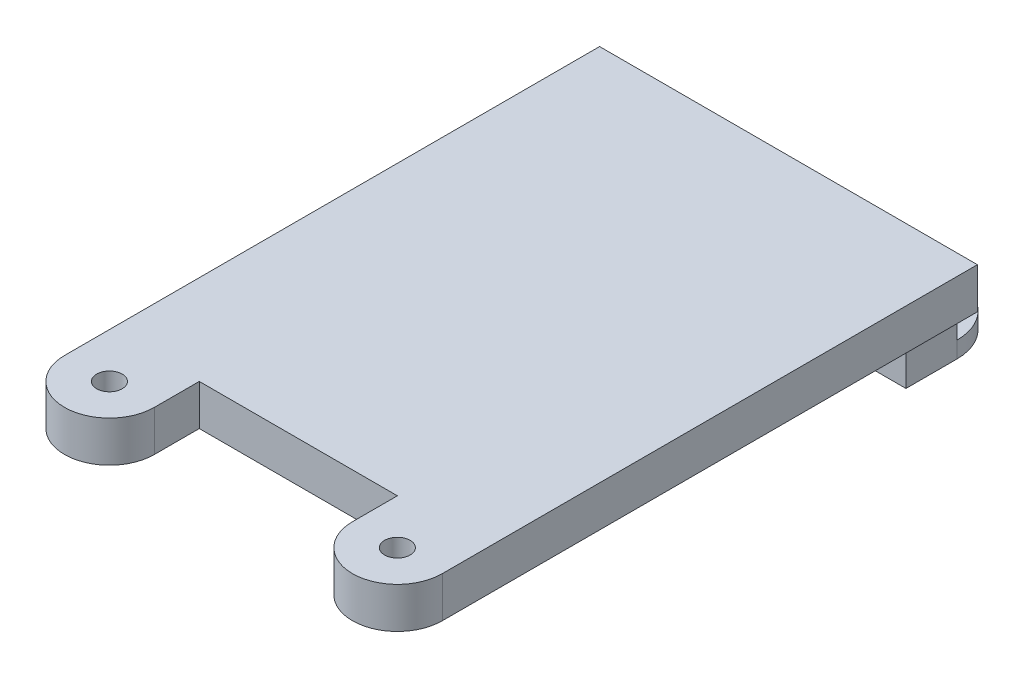
ISO-10303-21;
HEADER;
FILE_DESCRIPTION(('STEP AP214'),'2;1');
FILE_NAME('part.step','',(''),(''),'','','');
FILE_SCHEMA(('AUTOMOTIVE_DESIGN { 1 0 10303 214 1 1 1 1 }'));
ENDSEC;
DATA;
#1=APPLICATION_CONTEXT('core data for automotive mechanical design processes');
#2=APPLICATION_PROTOCOL_DEFINITION('international standard','automotive_design',2000,#1);
#3=PRODUCT_CONTEXT('',#1,'mechanical');
#4=PRODUCT('Part','Part','',(#3));
#5=PRODUCT_RELATED_PRODUCT_CATEGORY('part','',(#4));
#6=PRODUCT_DEFINITION_FORMATION('','',#4);
#7=PRODUCT_DEFINITION_CONTEXT('part definition',#1,'design');
#8=PRODUCT_DEFINITION('design','',#6,#7);
#9=PRODUCT_DEFINITION_SHAPE('','',#8);
#10=(LENGTH_UNIT() NAMED_UNIT(*) SI_UNIT(.MILLI.,.METRE.));
#11=(NAMED_UNIT(*) PLANE_ANGLE_UNIT() SI_UNIT($,.RADIAN.));
#12=(NAMED_UNIT(*) SI_UNIT($,.STERADIAN.) SOLID_ANGLE_UNIT());
#13=UNCERTAINTY_MEASURE_WITH_UNIT(LENGTH_MEASURE(1.E-05),#10,'distance_accuracy_value','');
#14=(GEOMETRIC_REPRESENTATION_CONTEXT(3) GLOBAL_UNCERTAINTY_ASSIGNED_CONTEXT((#13)) GLOBAL_UNIT_ASSIGNED_CONTEXT((#10,
#11,#12)) REPRESENTATION_CONTEXT('',''));
#15=CARTESIAN_POINT('',(0.,0.,0.));
#16=DIRECTION('',(0.,0.,1.));
#17=DIRECTION('',(1.,0.,0.));
#18=AXIS2_PLACEMENT_3D('',#15,#16,#17);
#19=CARTESIAN_POINT('',(0.,2.,-12.));
#20=DIRECTION('',(0.,0.,-1.));
#21=DIRECTION('',(-1.,0.,0.));
#22=AXIS2_PLACEMENT_3D('',#19,#20,#21);
#23=PLANE('',#22);
#24=DIRECTION('',(0.,1.,0.));
#25=VECTOR('',#24,1.);
#26=CARTESIAN_POINT('',(8.25,-2.5,-12.));
#27=LINE('',#26,#25);
#28=CARTESIAN_POINT('',(8.25,-1.7,-12.));
#29=VERTEX_POINT('',#28);
#30=CARTESIAN_POINT('',(8.25,0.,-12.));
#31=VERTEX_POINT('',#30);
#32=EDGE_CURVE('E147',#29,#31,#27,.T.);
#33=ORIENTED_EDGE('',*,*,#32,.F.);
#34=DIRECTION('',(-1.,0.,0.));
#35=VECTOR('',#34,1.);
#36=CARTESIAN_POINT('',(8.25,-1.7,-12.));
#37=LINE('',#36,#35);
#38=CARTESIAN_POINT('',(-8.25,-1.7,-12.));
#39=VERTEX_POINT('',#38);
#40=EDGE_CURVE('E153',#29,#39,#37,.T.);
#41=ORIENTED_EDGE('',*,*,#40,.T.);
#42=DIRECTION('',(0.,1.,0.));
#43=VECTOR('',#42,1.);
#44=CARTESIAN_POINT('',(-8.25,-2.5,-12.));
#45=LINE('',#44,#43);
#46=CARTESIAN_POINT('',(-8.25,0.,-12.));
#47=VERTEX_POINT('',#46);
#48=EDGE_CURVE('E164',#39,#47,#45,.T.);
#49=ORIENTED_EDGE('',*,*,#48,.T.);
#50=DIRECTION('',(1.,0.,0.));
#51=VECTOR('',#50,1.);
#52=CARTESIAN_POINT('',(0.,0.,-12.));
#53=LINE('',#52,#51);
#54=CARTESIAN_POINT('',(-9.25,0.,-12.));
#55=VERTEX_POINT('',#54);
#56=EDGE_CURVE('E220',#55,#47,#53,.T.);
#57=ORIENTED_EDGE('',*,*,#56,.F.);
#58=DIRECTION('',(0.,-1.,0.));
#59=VECTOR('',#58,1.);
#60=CARTESIAN_POINT('',(-9.25,2.,-12.));
#61=LINE('',#60,#59);
#62=CARTESIAN_POINT('',(-9.25,2.,-12.));
#63=VERTEX_POINT('',#62);
#64=EDGE_CURVE('E251',#63,#55,#61,.T.);
#65=ORIENTED_EDGE('',*,*,#64,.F.);
#66=DIRECTION('',(1.,0.,0.));
#67=VECTOR('',#66,1.);
#68=CARTESIAN_POINT('',(0.,2.,-12.));
#69=LINE('',#68,#67);
#70=CARTESIAN_POINT('',(9.25,2.,-12.));
#71=VERTEX_POINT('',#70);
#72=EDGE_CURVE('E296',#63,#71,#69,.T.);
#73=ORIENTED_EDGE('',*,*,#72,.T.);
#74=DIRECTION('',(0.,-1.,0.));
#75=VECTOR('',#74,1.);
#76=CARTESIAN_POINT('',(9.25,2.,-12.));
#77=LINE('',#76,#75);
#78=CARTESIAN_POINT('',(9.25,0.,-12.));
#79=VERTEX_POINT('',#78);
#80=EDGE_CURVE('E253',#71,#79,#77,.T.);
#81=ORIENTED_EDGE('',*,*,#80,.T.);
#82=EDGE_CURVE('E163',#31,#79,#53,.T.);
#83=ORIENTED_EDGE('',*,*,#82,.F.);
#84=EDGE_LOOP('',(#33,#41,#49,#57,#65,#73,#81,#83));
#85=FACE_BOUND('',#84,.T.);
#86=ADVANCED_FACE('F35',(#85),#23,.T.);
#87=CARTESIAN_POINT('',(0.,0.,0.));
#88=DIRECTION('',(0.,1.,0.));
#89=DIRECTION('',(0.,0.,1.));
#90=AXIS2_PLACEMENT_3D('',#87,#88,#89);
#91=PLANE('',#90);
#92=CARTESIAN_POINT('',(-7.05,0.,14.2));
#93=DIRECTION('',(0.,1.,0.));
#94=DIRECTION('',(0.,0.,1.));
#95=AXIS2_PLACEMENT_3D('',#92,#93,#94);
#96=CIRCLE('',#95,0.625);
#97=CARTESIAN_POINT('',(-7.05,0.,14.825));
#98=VERTEX_POINT('',#97);
#99=EDGE_CURVE('E238',#98,#98,#96,.T.);
#100=ORIENTED_EDGE('',*,*,#99,.T.);
#101=EDGE_LOOP('',(#100));
#102=FACE_BOUND('',#101,.T.);
#103=CARTESIAN_POINT('',(7.05,0.,14.2));
#104=DIRECTION('',(0.,1.,0.));
#105=DIRECTION('',(0.,0.,1.));
#106=AXIS2_PLACEMENT_3D('',#103,#104,#105);
#107=CIRCLE('',#106,0.625);
#108=CARTESIAN_POINT('',(7.05,0.,14.825));
#109=VERTEX_POINT('',#108);
#110=EDGE_CURVE('E235',#109,#109,#107,.T.);
#111=ORIENTED_EDGE('',*,*,#110,.T.);
#112=EDGE_LOOP('',(#111));
#113=FACE_BOUND('',#112,.T.);
#114=DIRECTION('',(0.,0.,-1.));
#115=VECTOR('',#114,1.);
#116=CARTESIAN_POINT('',(-8.25,0.,-12.));
#117=LINE('',#116,#115);
#118=CARTESIAN_POINT('',(-8.25,0.,-9.5));
#119=VERTEX_POINT('',#118);
#120=EDGE_CURVE('E194',#119,#47,#117,.T.);
#121=ORIENTED_EDGE('',*,*,#120,.F.);
#122=DIRECTION('',(-1.,0.,0.));
#123=VECTOR('',#122,1.);
#124=CARTESIAN_POINT('',(-8.25,0.,-9.5));
#125=LINE('',#124,#123);
#126=CARTESIAN_POINT('',(8.25,0.,-9.5));
#127=VERTEX_POINT('',#126);
#128=EDGE_CURVE('E200',#127,#119,#125,.T.);
#129=ORIENTED_EDGE('',*,*,#128,.F.);
#130=DIRECTION('',(0.,0.,1.));
#131=VECTOR('',#130,1.);
#132=CARTESIAN_POINT('',(8.25,0.,-12.));
#133=LINE('',#132,#131);
#134=EDGE_CURVE('E210',#31,#127,#133,.T.);
#135=ORIENTED_EDGE('',*,*,#134,.F.);
#136=ORIENTED_EDGE('',*,*,#82,.T.);
#137=DIRECTION('',(0.,0.,-1.));
#138=VECTOR('',#137,1.);
#139=CARTESIAN_POINT('',(9.25,0.,0.));
#140=LINE('',#139,#138);
#141=CARTESIAN_POINT('',(9.25,0.,14.2));
#142=VERTEX_POINT('',#141);
#143=EDGE_CURVE('E221',#142,#79,#140,.T.);
#144=ORIENTED_EDGE('',*,*,#143,.F.);
#145=CARTESIAN_POINT('',(7.05,0.,14.2));
#146=DIRECTION('',(0.,1.,0.));
#147=DIRECTION('',(0.,0.,1.));
#148=AXIS2_PLACEMENT_3D('',#145,#146,#147);
#149=CIRCLE('',#148,2.2);
#150=CARTESIAN_POINT('',(4.85,0.,14.2));
#151=VERTEX_POINT('',#150);
#152=EDGE_CURVE('E281',#151,#142,#149,.T.);
#153=ORIENTED_EDGE('',*,*,#152,.F.);
#154=DIRECTION('',(0.,0.,-1.));
#155=VECTOR('',#154,1.);
#156=CARTESIAN_POINT('',(4.85,0.,0.));
#157=LINE('',#156,#155);
#158=CARTESIAN_POINT('',(4.85,0.,12.));
#159=VERTEX_POINT('',#158);
#160=EDGE_CURVE('E266',#151,#159,#157,.T.);
#161=ORIENTED_EDGE('',*,*,#160,.T.);
#162=DIRECTION('',(1.,0.,0.));
#163=VECTOR('',#162,1.);
#164=CARTESIAN_POINT('',(0.,0.,12.));
#165=LINE('',#164,#163);
#166=CARTESIAN_POINT('',(-4.85,0.,12.));
#167=VERTEX_POINT('',#166);
#168=EDGE_CURVE('E272',#167,#159,#165,.T.);
#169=ORIENTED_EDGE('',*,*,#168,.F.);
#170=DIRECTION('',(0.,0.,-1.));
#171=VECTOR('',#170,1.);
#172=CARTESIAN_POINT('',(-4.85,0.,0.));
#173=LINE('',#172,#171);
#174=CARTESIAN_POINT('',(-4.85,0.,14.2));
#175=VERTEX_POINT('',#174);
#176=EDGE_CURVE('E233',#175,#167,#173,.T.);
#177=ORIENTED_EDGE('',*,*,#176,.F.);
#178=CARTESIAN_POINT('',(-7.05,0.,14.2));
#179=DIRECTION('',(0.,1.,0.));
#180=DIRECTION('',(0.,0.,1.));
#181=AXIS2_PLACEMENT_3D('',#178,#179,#180);
#182=CIRCLE('',#181,2.2);
#183=CARTESIAN_POINT('',(-9.25,0.,14.2));
#184=VERTEX_POINT('',#183);
#185=EDGE_CURVE('E231',#184,#175,#182,.T.);
#186=ORIENTED_EDGE('',*,*,#185,.F.);
#187=DIRECTION('',(0.,0.,-1.));
#188=VECTOR('',#187,1.);
#189=CARTESIAN_POINT('',(-9.25,0.,0.));
#190=LINE('',#189,#188);
#191=EDGE_CURVE('E227',#184,#55,#190,.T.);
#192=ORIENTED_EDGE('',*,*,#191,.T.);
#193=ORIENTED_EDGE('',*,*,#56,.T.);
#194=EDGE_LOOP('',(#121,#129,#135,#136,#144,#153,#161,#169,#177,#186,#192,#193));
#195=FACE_BOUND('',#194,.T.);
#196=ADVANCED_FACE('F279',(#102,#113,#195),#91,.F.);
#197=CARTESIAN_POINT('',(0.,2.,12.));
#198=DIRECTION('',(0.,0.,-1.));
#199=DIRECTION('',(-1.,0.,0.));
#200=AXIS2_PLACEMENT_3D('',#197,#198,#199);
#201=PLANE('',#200);
#202=ORIENTED_EDGE('',*,*,#168,.T.);
#203=DIRECTION('',(0.,-1.,0.));
#204=VECTOR('',#203,1.);
#205=CARTESIAN_POINT('',(4.85,2.,12.));
#206=LINE('',#205,#204);
#207=CARTESIAN_POINT('',(4.85,2.,12.));
#208=VERTEX_POINT('',#207);
#209=EDGE_CURVE('E187',#208,#159,#206,.T.);
#210=ORIENTED_EDGE('',*,*,#209,.F.);
#211=DIRECTION('',(1.,0.,0.));
#212=VECTOR('',#211,1.);
#213=CARTESIAN_POINT('',(0.,2.,12.));
#214=LINE('',#213,#212);
#215=CARTESIAN_POINT('',(-4.85,2.,12.));
#216=VERTEX_POINT('',#215);
#217=EDGE_CURVE('E241',#216,#208,#214,.T.);
#218=ORIENTED_EDGE('',*,*,#217,.F.);
#219=DIRECTION('',(0.,-1.,0.));
#220=VECTOR('',#219,1.);
#221=CARTESIAN_POINT('',(-4.85,2.,12.));
#222=LINE('',#221,#220);
#223=EDGE_CURVE('E242',#216,#167,#222,.T.);
#224=ORIENTED_EDGE('',*,*,#223,.T.);
#225=EDGE_LOOP('',(#202,#210,#218,#224));
#226=FACE_BOUND('',#225,.T.);
#227=ADVANCED_FACE('F273',(#226),#201,.F.);
#228=CARTESIAN_POINT('',(4.85,2.,0.));
#229=DIRECTION('',(-1.,0.,0.));
#230=DIRECTION('',(0.,0.,1.));
#231=AXIS2_PLACEMENT_3D('',#228,#229,#230);
#232=PLANE('',#231);
#233=ORIENTED_EDGE('',*,*,#160,.F.);
#234=DIRECTION('',(0.,-1.,0.));
#235=VECTOR('',#234,1.);
#236=CARTESIAN_POINT('',(4.85,2.,14.2));
#237=LINE('',#236,#235);
#238=CARTESIAN_POINT('',(4.85,2.,14.2));
#239=VERTEX_POINT('',#238);
#240=EDGE_CURVE('E258',#239,#151,#237,.T.);
#241=ORIENTED_EDGE('',*,*,#240,.F.);
#242=DIRECTION('',(0.,0.,-1.));
#243=VECTOR('',#242,1.);
#244=CARTESIAN_POINT('',(4.85,2.,0.));
#245=LINE('',#244,#243);
#246=EDGE_CURVE('E268',#239,#208,#245,.T.);
#247=ORIENTED_EDGE('',*,*,#246,.T.);
#248=ORIENTED_EDGE('',*,*,#209,.T.);
#249=EDGE_LOOP('',(#233,#241,#247,#248));
#250=FACE_BOUND('',#249,.T.);
#251=ADVANCED_FACE('F264',(#250),#232,.T.);
#252=CARTESIAN_POINT('',(7.05,2.,14.2));
#253=DIRECTION('',(0.,-1.,0.));
#254=DIRECTION('',(0.,0.,-1.));
#255=AXIS2_PLACEMENT_3D('',#252,#253,#254);
#256=CYLINDRICAL_SURFACE('',#255,2.2);
#257=ORIENTED_EDGE('',*,*,#152,.T.);
#258=DIRECTION('',(0.,-1.,0.));
#259=VECTOR('',#258,1.);
#260=CARTESIAN_POINT('',(9.25,2.,14.2));
#261=LINE('',#260,#259);
#262=CARTESIAN_POINT('',(9.25,2.,14.2));
#263=VERTEX_POINT('',#262);
#264=EDGE_CURVE('E255',#263,#142,#261,.T.);
#265=ORIENTED_EDGE('',*,*,#264,.F.);
#266=CARTESIAN_POINT('',(7.05,2.,14.2));
#267=DIRECTION('',(0.,1.,0.));
#268=DIRECTION('',(0.,0.,1.));
#269=AXIS2_PLACEMENT_3D('',#266,#267,#268);
#270=CIRCLE('',#269,2.2);
#271=EDGE_CURVE('E301',#239,#263,#270,.T.);
#272=ORIENTED_EDGE('',*,*,#271,.F.);
#273=ORIENTED_EDGE('',*,*,#240,.T.);
#274=EDGE_LOOP('',(#257,#265,#272,#273));
#275=FACE_BOUND('',#274,.T.);
#276=ADVANCED_FACE('F348',(#275),#256,.T.);
#277=CARTESIAN_POINT('',(9.25,2.,0.));
#278=DIRECTION('',(-1.,0.,0.));
#279=DIRECTION('',(0.,0.,1.));
#280=AXIS2_PLACEMENT_3D('',#277,#278,#279);
#281=PLANE('',#280);
#282=ORIENTED_EDGE('',*,*,#143,.T.);
#283=ORIENTED_EDGE('',*,*,#80,.F.);
#284=DIRECTION('',(0.,0.,-1.));
#285=VECTOR('',#284,1.);
#286=CARTESIAN_POINT('',(9.25,2.,0.));
#287=LINE('',#286,#285);
#288=EDGE_CURVE('E299',#263,#71,#287,.T.);
#289=ORIENTED_EDGE('',*,*,#288,.F.);
#290=ORIENTED_EDGE('',*,*,#264,.T.);
#291=EDGE_LOOP('',(#282,#283,#289,#290));
#292=FACE_BOUND('',#291,.T.);
#293=ADVANCED_FACE('F345',(#292),#281,.F.);
#294=CARTESIAN_POINT('',(-9.25,2.,0.));
#295=DIRECTION('',(-1.,0.,0.));
#296=DIRECTION('',(0.,0.,1.));
#297=AXIS2_PLACEMENT_3D('',#294,#295,#296);
#298=PLANE('',#297);
#299=ORIENTED_EDGE('',*,*,#191,.F.);
#300=DIRECTION('',(0.,-1.,0.));
#301=VECTOR('',#300,1.);
#302=CARTESIAN_POINT('',(-9.25,2.,14.2));
#303=LINE('',#302,#301);
#304=CARTESIAN_POINT('',(-9.25,2.,14.2));
#305=VERTEX_POINT('',#304);
#306=EDGE_CURVE('E249',#305,#184,#303,.T.);
#307=ORIENTED_EDGE('',*,*,#306,.F.);
#308=DIRECTION('',(0.,0.,-1.));
#309=VECTOR('',#308,1.);
#310=CARTESIAN_POINT('',(-9.25,2.,0.));
#311=LINE('',#310,#309);
#312=EDGE_CURVE('E293',#305,#63,#311,.T.);
#313=ORIENTED_EDGE('',*,*,#312,.T.);
#314=ORIENTED_EDGE('',*,*,#64,.T.);
#315=EDGE_LOOP('',(#299,#307,#313,#314));
#316=FACE_BOUND('',#315,.T.);
#317=ADVANCED_FACE('F343',(#316),#298,.T.);
#318=CARTESIAN_POINT('',(-7.05,2.,14.2));
#319=DIRECTION('',(0.,-1.,0.));
#320=DIRECTION('',(0.,0.,-1.));
#321=AXIS2_PLACEMENT_3D('',#318,#319,#320);
#322=CYLINDRICAL_SURFACE('',#321,2.2);
#323=ORIENTED_EDGE('',*,*,#185,.T.);
#324=DIRECTION('',(0.,-1.,0.));
#325=VECTOR('',#324,1.);
#326=CARTESIAN_POINT('',(-4.85,2.,14.2));
#327=LINE('',#326,#325);
#328=CARTESIAN_POINT('',(-4.85,2.,14.2));
#329=VERTEX_POINT('',#328);
#330=EDGE_CURVE('E245',#329,#175,#327,.T.);
#331=ORIENTED_EDGE('',*,*,#330,.F.);
#332=CARTESIAN_POINT('',(-7.05,2.,14.2));
#333=DIRECTION('',(0.,1.,0.));
#334=DIRECTION('',(0.,0.,1.));
#335=AXIS2_PLACEMENT_3D('',#332,#333,#334);
#336=CIRCLE('',#335,2.2);
#337=EDGE_CURVE('E291',#305,#329,#336,.T.);
#338=ORIENTED_EDGE('',*,*,#337,.F.);
#339=ORIENTED_EDGE('',*,*,#306,.T.);
#340=EDGE_LOOP('',(#323,#331,#338,#339));
#341=FACE_BOUND('',#340,.T.);
#342=ADVANCED_FACE('F464',(#341),#322,.T.);
#343=CARTESIAN_POINT('',(7.05,2.,14.2));
#344=DIRECTION('',(0.,-1.,0.));
#345=DIRECTION('',(0.,0.,-1.));
#346=AXIS2_PLACEMENT_3D('',#343,#344,#345);
#347=CYLINDRICAL_SURFACE('',#346,0.625);
#348=CARTESIAN_POINT('',(7.05,2.,14.2));
#349=DIRECTION('',(0.,1.,0.));
#350=DIRECTION('',(0.,0.,1.));
#351=AXIS2_PLACEMENT_3D('',#348,#349,#350);
#352=CIRCLE('',#351,0.625);
#353=CARTESIAN_POINT('',(7.05,2.,14.825));
#354=VERTEX_POINT('',#353);
#355=EDGE_CURVE('E286',#354,#354,#352,.T.);
#356=ORIENTED_EDGE('',*,*,#355,.T.);
#357=EDGE_LOOP('',(#356));
#358=FACE_BOUND('',#357,.T.);
#359=ORIENTED_EDGE('',*,*,#110,.F.);
#360=EDGE_LOOP('',(#359));
#361=FACE_BOUND('',#360,.T.);
#362=ADVANCED_FACE('F454',(#358,#361),#347,.F.);
#363=CARTESIAN_POINT('',(-4.85,2.,0.));
#364=DIRECTION('',(-1.,0.,0.));
#365=DIRECTION('',(0.,0.,1.));
#366=AXIS2_PLACEMENT_3D('',#363,#364,#365);
#367=PLANE('',#366);
#368=ORIENTED_EDGE('',*,*,#176,.T.);
#369=ORIENTED_EDGE('',*,*,#223,.F.);
#370=DIRECTION('',(0.,0.,-1.));
#371=VECTOR('',#370,1.);
#372=CARTESIAN_POINT('',(-4.85,2.,0.));
#373=LINE('',#372,#371);
#374=EDGE_CURVE('E289',#329,#216,#373,.T.);
#375=ORIENTED_EDGE('',*,*,#374,.F.);
#376=ORIENTED_EDGE('',*,*,#330,.T.);
#377=EDGE_LOOP('',(#368,#369,#375,#376));
#378=FACE_BOUND('',#377,.T.);
#379=ADVANCED_FACE('F443',(#378),#367,.F.);
#380=CARTESIAN_POINT('',(-7.05,2.,14.2));
#381=DIRECTION('',(0.,-1.,0.));
#382=DIRECTION('',(0.,0.,-1.));
#383=AXIS2_PLACEMENT_3D('',#380,#381,#382);
#384=CYLINDRICAL_SURFACE('',#383,0.625);
#385=CARTESIAN_POINT('',(-7.05,2.,14.2));
#386=DIRECTION('',(0.,1.,0.));
#387=DIRECTION('',(0.,0.,1.));
#388=AXIS2_PLACEMENT_3D('',#385,#386,#387);
#389=CIRCLE('',#388,0.625);
#390=CARTESIAN_POINT('',(-7.05,2.,14.825));
#391=VERTEX_POINT('',#390);
#392=EDGE_CURVE('E246',#391,#391,#389,.T.);
#393=ORIENTED_EDGE('',*,*,#392,.T.);
#394=EDGE_LOOP('',(#393));
#395=FACE_BOUND('',#394,.T.);
#396=ORIENTED_EDGE('',*,*,#99,.F.);
#397=EDGE_LOOP('',(#396));
#398=FACE_BOUND('',#397,.T.);
#399=ADVANCED_FACE('F431',(#395,#398),#384,.F.);
#400=CARTESIAN_POINT('',(0.,2.,0.));
#401=DIRECTION('',(0.,1.,0.));
#402=DIRECTION('',(0.,0.,1.));
#403=AXIS2_PLACEMENT_3D('',#400,#401,#402);
#404=PLANE('',#403);
#405=ORIENTED_EDGE('',*,*,#217,.T.);
#406=ORIENTED_EDGE('',*,*,#246,.F.);
#407=ORIENTED_EDGE('',*,*,#271,.T.);
#408=ORIENTED_EDGE('',*,*,#288,.T.);
#409=ORIENTED_EDGE('',*,*,#72,.F.);
#410=ORIENTED_EDGE('',*,*,#312,.F.);
#411=ORIENTED_EDGE('',*,*,#337,.T.);
#412=ORIENTED_EDGE('',*,*,#374,.T.);
#413=EDGE_LOOP('',(#405,#406,#407,#408,#409,#410,#411,#412));
#414=FACE_BOUND('',#413,.T.);
#415=ORIENTED_EDGE('',*,*,#355,.F.);
#416=EDGE_LOOP('',(#415));
#417=FACE_BOUND('',#416,.T.);
#418=ORIENTED_EDGE('',*,*,#392,.F.);
#419=EDGE_LOOP('',(#418));
#420=FACE_BOUND('',#419,.T.);
#421=ADVANCED_FACE('F401',(#414,#417,#420),#404,.T.);
#422=CARTESIAN_POINT('',(-8.25,-2.5,-12.));
#423=DIRECTION('',(1.,0.,0.));
#424=DIRECTION('',(0.,0.,-1.));
#425=AXIS2_PLACEMENT_3D('',#422,#423,#424);
#426=PLANE('',#425);
#427=ORIENTED_EDGE('',*,*,#48,.F.);
#428=DIRECTION('',(0.,-1.,0.));
#429=VECTOR('',#428,1.);
#430=CARTESIAN_POINT('',(-8.25,-2.5,-12.));
#431=LINE('',#430,#429);
#432=CARTESIAN_POINT('',(-8.25,-2.5,-12.));
#433=VERTEX_POINT('',#432);
#434=EDGE_CURVE('E183',#39,#433,#431,.T.);
#435=ORIENTED_EDGE('',*,*,#434,.T.);
#436=DIRECTION('',(0.,0.,-1.));
#437=VECTOR('',#436,1.);
#438=CARTESIAN_POINT('',(-8.25,-2.5,-12.));
#439=LINE('',#438,#437);
#440=CARTESIAN_POINT('',(-8.25,-2.5,-9.5));
#441=VERTEX_POINT('',#440);
#442=EDGE_CURVE('E197',#441,#433,#439,.T.);
#443=ORIENTED_EDGE('',*,*,#442,.F.);
#444=DIRECTION('',(0.,1.,0.));
#445=VECTOR('',#444,1.);
#446=CARTESIAN_POINT('',(-8.25,-2.5,-9.5));
#447=LINE('',#446,#445);
#448=EDGE_CURVE('E204',#441,#119,#447,.T.);
#449=ORIENTED_EDGE('',*,*,#448,.T.);
#450=ORIENTED_EDGE('',*,*,#120,.T.);
#451=EDGE_LOOP('',(#427,#435,#443,#449,#450));
#452=FACE_BOUND('',#451,.T.);
#453=ADVANCED_FACE('F310',(#452),#426,.F.);
#454=CARTESIAN_POINT('',(8.25,-2.5,-12.));
#455=DIRECTION('',(-1.,0.,0.));
#456=DIRECTION('',(0.,0.,1.));
#457=AXIS2_PLACEMENT_3D('',#454,#455,#456);
#458=PLANE('',#457);
#459=DIRECTION('',(0.,0.,1.));
#460=VECTOR('',#459,1.);
#461=CARTESIAN_POINT('',(8.25,-2.5,-12.));
#462=LINE('',#461,#460);
#463=CARTESIAN_POINT('',(8.25,-2.5,-12.));
#464=VERTEX_POINT('',#463);
#465=CARTESIAN_POINT('',(8.25,-2.5,-9.5));
#466=VERTEX_POINT('',#465);
#467=EDGE_CURVE('E150',#464,#466,#462,.T.);
#468=ORIENTED_EDGE('',*,*,#467,.F.);
#469=DIRECTION('',(0.,-1.,0.));
#470=VECTOR('',#469,1.);
#471=CARTESIAN_POINT('',(8.25,-1.7,-12.));
#472=LINE('',#471,#470);
#473=EDGE_CURVE('E11',#464,#29,#472,.F.);
#474=ORIENTED_EDGE('',*,*,#473,.T.);
#475=ORIENTED_EDGE('',*,*,#32,.T.);
#476=ORIENTED_EDGE('',*,*,#134,.T.);
#477=DIRECTION('',(0.,1.,0.));
#478=VECTOR('',#477,1.);
#479=CARTESIAN_POINT('',(8.25,-2.5,-9.5));
#480=LINE('',#479,#478);
#481=EDGE_CURVE('E165',#466,#127,#480,.T.);
#482=ORIENTED_EDGE('',*,*,#481,.F.);
#483=EDGE_LOOP('',(#468,#474,#475,#476,#482));
#484=FACE_BOUND('',#483,.T.);
#485=ADVANCED_FACE('F144',(#484),#458,.F.);
#486=CARTESIAN_POINT('',(-8.25,-2.5,-9.5));
#487=DIRECTION('',(0.,0.,-1.));
#488=DIRECTION('',(-1.,0.,0.));
#489=AXIS2_PLACEMENT_3D('',#486,#487,#488);
#490=PLANE('',#489);
#491=ORIENTED_EDGE('',*,*,#128,.T.);
#492=ORIENTED_EDGE('',*,*,#448,.F.);
#493=DIRECTION('',(-1.,0.,0.));
#494=VECTOR('',#493,1.);
#495=CARTESIAN_POINT('',(-8.25,-2.5,-9.5));
#496=LINE('',#495,#494);
#497=EDGE_CURVE('E202',#466,#441,#496,.T.);
#498=ORIENTED_EDGE('',*,*,#497,.F.);
#499=ORIENTED_EDGE('',*,*,#481,.T.);
#500=EDGE_LOOP('',(#491,#492,#498,#499));
#501=FACE_BOUND('',#500,.T.);
#502=ADVANCED_FACE('F314',(#501),#490,.F.);
#503=CARTESIAN_POINT('',(0.,-2.5,0.));
#504=DIRECTION('',(0.,1.,0.));
#505=DIRECTION('',(0.,0.,1.));
#506=AXIS2_PLACEMENT_3D('',#503,#504,#505);
#507=PLANE('',#506);
#508=ORIENTED_EDGE('',*,*,#442,.T.);
#509=CARTESIAN_POINT('',(-5.75,-2.5,-12.));
#510=DIRECTION('',(0.,1.,0.));
#511=DIRECTION('',(0.,0.,1.));
#512=AXIS2_PLACEMENT_3D('',#509,#510,#511);
#513=CIRCLE('',#512,2.5);
#514=CARTESIAN_POINT('',(-5.75,-2.5,-14.5));
#515=VERTEX_POINT('',#514);
#516=EDGE_CURVE('E179',#433,#515,#513,.F.);
#517=ORIENTED_EDGE('',*,*,#516,.T.);
#518=DIRECTION('',(1.,0.,0.));
#519=VECTOR('',#518,1.);
#520=CARTESIAN_POINT('',(8.25,-2.5,-14.5));
#521=LINE('',#520,#519);
#522=CARTESIAN_POINT('',(5.75,-2.5,-14.5));
#523=VERTEX_POINT('',#522);
#524=EDGE_CURVE('E159',#515,#523,#521,.T.);
#525=ORIENTED_EDGE('',*,*,#524,.T.);
#526=CARTESIAN_POINT('',(5.75,-2.5,-12.));
#527=DIRECTION('',(0.,1.,0.));
#528=DIRECTION('',(0.,0.,1.));
#529=AXIS2_PLACEMENT_3D('',#526,#527,#528);
#530=CIRCLE('',#529,2.5);
#531=EDGE_CURVE('E181',#523,#464,#530,.F.);
#532=ORIENTED_EDGE('',*,*,#531,.T.);
#533=ORIENTED_EDGE('',*,*,#467,.T.);
#534=ORIENTED_EDGE('',*,*,#497,.T.);
#535=EDGE_LOOP('',(#508,#517,#525,#532,#533,#534));
#536=FACE_BOUND('',#535,.T.);
#537=ADVANCED_FACE('F324',(#536),#507,.F.);
#538=CARTESIAN_POINT('',(8.25,-1.7,-14.5));
#539=DIRECTION('',(0.,0.,-1.));
#540=DIRECTION('',(-1.,0.,0.));
#541=AXIS2_PLACEMENT_3D('',#538,#539,#540);
#542=PLANE('',#541);
#543=ORIENTED_EDGE('',*,*,#524,.F.);
#544=DIRECTION('',(0.,-1.,0.));
#545=VECTOR('',#544,1.);
#546=CARTESIAN_POINT('',(-5.75,-1.7,-14.5));
#547=LINE('',#546,#545);
#548=CARTESIAN_POINT('',(-5.75,-1.7,-14.5));
#549=VERTEX_POINT('',#548);
#550=EDGE_CURVE('E58',#515,#549,#547,.F.);
#551=ORIENTED_EDGE('',*,*,#550,.T.);
#552=DIRECTION('',(1.,0.,0.));
#553=VECTOR('',#552,1.);
#554=CARTESIAN_POINT('',(8.25,-1.7,-14.5));
#555=LINE('',#554,#553);
#556=CARTESIAN_POINT('',(5.75,-1.7,-14.5));
#557=VERTEX_POINT('',#556);
#558=EDGE_CURVE('E158',#549,#557,#555,.T.);
#559=ORIENTED_EDGE('',*,*,#558,.T.);
#560=DIRECTION('',(0.,-1.,0.));
#561=VECTOR('',#560,1.);
#562=CARTESIAN_POINT('',(5.75,-2.5,-14.5));
#563=LINE('',#562,#561);
#564=EDGE_CURVE('E169',#557,#523,#563,.T.);
#565=ORIENTED_EDGE('',*,*,#564,.T.);
#566=EDGE_LOOP('',(#543,#551,#559,#565));
#567=FACE_BOUND('',#566,.T.);
#568=ADVANCED_FACE('F325',(#567),#542,.T.);
#569=CARTESIAN_POINT('',(0.,-1.7,0.));
#570=DIRECTION('',(0.,1.,0.));
#571=DIRECTION('',(0.,0.,1.));
#572=AXIS2_PLACEMENT_3D('',#569,#570,#571);
#573=PLANE('',#572);
#574=ORIENTED_EDGE('',*,*,#558,.F.);
#575=CARTESIAN_POINT('',(-5.75,-1.7,-12.));
#576=DIRECTION('',(0.,1.,0.));
#577=DIRECTION('',(0.,0.,1.));
#578=AXIS2_PLACEMENT_3D('',#575,#576,#577);
#579=CIRCLE('',#578,2.5);
#580=EDGE_CURVE('E44',#549,#39,#579,.T.);
#581=ORIENTED_EDGE('',*,*,#580,.T.);
#582=ORIENTED_EDGE('',*,*,#40,.F.);
#583=CARTESIAN_POINT('',(5.75,-1.7,-12.));
#584=DIRECTION('',(0.,1.,0.));
#585=DIRECTION('',(0.,0.,1.));
#586=AXIS2_PLACEMENT_3D('',#583,#584,#585);
#587=CIRCLE('',#586,2.5);
#588=EDGE_CURVE('E51',#29,#557,#587,.T.);
#589=ORIENTED_EDGE('',*,*,#588,.T.);
#590=EDGE_LOOP('',(#574,#581,#582,#589));
#591=FACE_BOUND('',#590,.T.);
#592=ADVANCED_FACE('F154',(#591),#573,.T.);
#593=CARTESIAN_POINT('',(-5.75,-2.5,-12.));
#594=DIRECTION('',(0.,1.,0.));
#595=DIRECTION('',(0.,0.,1.));
#596=AXIS2_PLACEMENT_3D('',#593,#594,#595);
#597=CYLINDRICAL_SURFACE('',#596,2.5);
#598=ORIENTED_EDGE('',*,*,#580,.F.);
#599=ORIENTED_EDGE('',*,*,#550,.F.);
#600=ORIENTED_EDGE('',*,*,#516,.F.);
#601=ORIENTED_EDGE('',*,*,#434,.F.);
#602=EDGE_LOOP('',(#598,#599,#600,#601));
#603=FACE_BOUND('',#602,.T.);
#604=ADVANCED_FACE('F322',(#603),#597,.T.);
#605=CARTESIAN_POINT('',(5.75,-1.7,-12.));
#606=DIRECTION('',(0.,1.,0.));
#607=DIRECTION('',(0.,0.,1.));
#608=AXIS2_PLACEMENT_3D('',#605,#606,#607);
#609=CYLINDRICAL_SURFACE('',#608,2.5);
#610=ORIENTED_EDGE('',*,*,#588,.F.);
#611=ORIENTED_EDGE('',*,*,#473,.F.);
#612=ORIENTED_EDGE('',*,*,#531,.F.);
#613=ORIENTED_EDGE('',*,*,#564,.F.);
#614=EDGE_LOOP('',(#610,#611,#612,#613));
#615=FACE_BOUND('',#614,.T.);
#616=ADVANCED_FACE('F37',(#615),#609,.T.);
#617=CLOSED_SHELL('',(#86,#196,#227,#251,#276,#293,#317,#342,#362,#379,#399,#421,#453,#485,#502,
#537,#568,#592,#604,#616));
#618=MANIFOLD_SOLID_BREP('B2',#617);
#619=ADVANCED_BREP_SHAPE_REPRESENTATION('',(#18,#618),#14);
#620=SHAPE_DEFINITION_REPRESENTATION(#9,#619);
ENDSEC;
END-ISO-10303-21;
